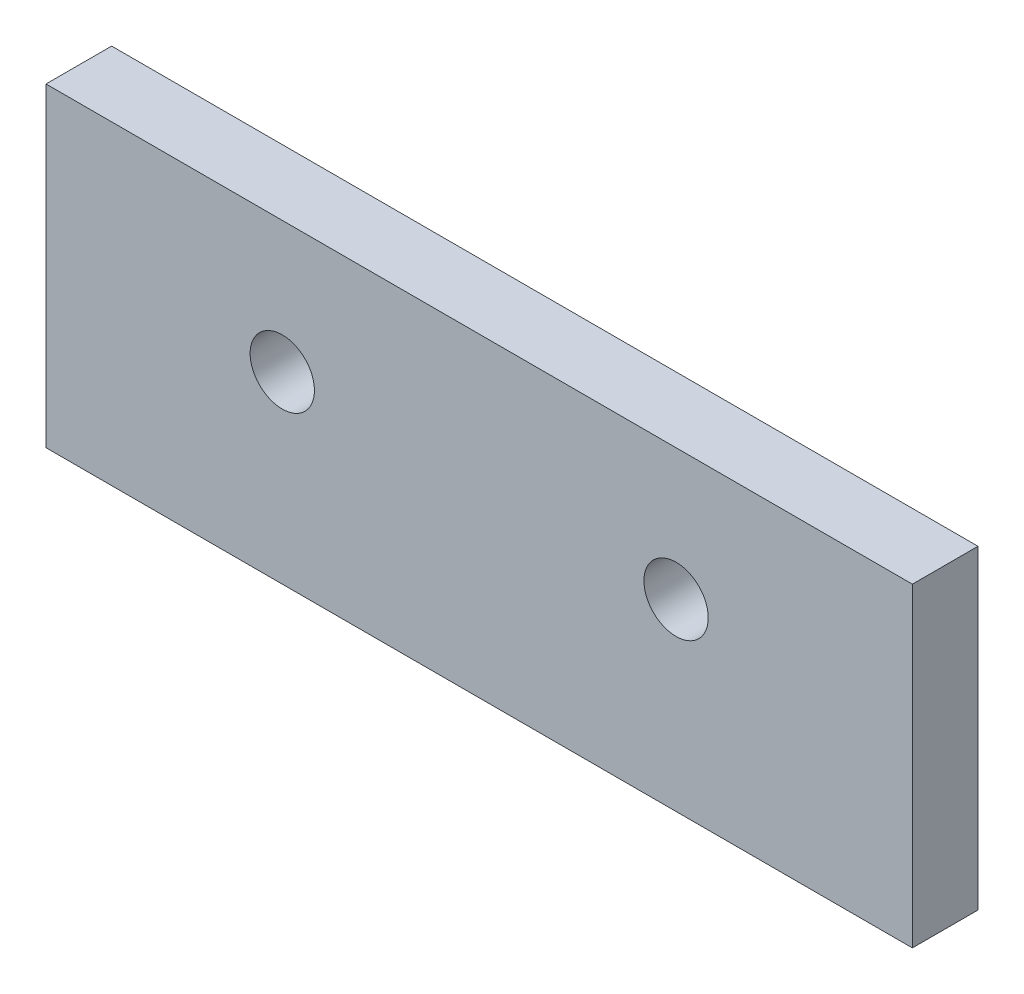
ISO-10303-21;
HEADER;
FILE_DESCRIPTION(('STEP AP214'),'2;1');
FILE_NAME('part.step','',(''),(''),'','','');
FILE_SCHEMA(('AUTOMOTIVE_DESIGN { 1 0 10303 214 1 1 1 1 }'));
ENDSEC;
DATA;
#1=APPLICATION_CONTEXT('core data for automotive mechanical design processes');
#2=APPLICATION_PROTOCOL_DEFINITION('international standard','automotive_design',2000,#1);
#3=PRODUCT_CONTEXT('',#1,'mechanical');
#4=PRODUCT('Part','Part','',(#3));
#5=PRODUCT_RELATED_PRODUCT_CATEGORY('part','',(#4));
#6=PRODUCT_DEFINITION_FORMATION('','',#4);
#7=PRODUCT_DEFINITION_CONTEXT('part definition',#1,'design');
#8=PRODUCT_DEFINITION('design','',#6,#7);
#9=PRODUCT_DEFINITION_SHAPE('','',#8);
#10=(LENGTH_UNIT() NAMED_UNIT(*) SI_UNIT(.MILLI.,.METRE.));
#11=(NAMED_UNIT(*) PLANE_ANGLE_UNIT() SI_UNIT($,.RADIAN.));
#12=(NAMED_UNIT(*) SI_UNIT($,.STERADIAN.) SOLID_ANGLE_UNIT());
#13=UNCERTAINTY_MEASURE_WITH_UNIT(LENGTH_MEASURE(1.E-05),#10,'distance_accuracy_value','');
#14=(GEOMETRIC_REPRESENTATION_CONTEXT(3) GLOBAL_UNCERTAINTY_ASSIGNED_CONTEXT((#13)) GLOBAL_UNIT_ASSIGNED_CONTEXT((#10,
#11,#12)) REPRESENTATION_CONTEXT('',''));
#15=CARTESIAN_POINT('',(0.,0.,0.));
#16=DIRECTION('',(0.,0.,1.));
#17=DIRECTION('',(1.,0.,0.));
#18=AXIS2_PLACEMENT_3D('',#15,#16,#17);
#19=CARTESIAN_POINT('',(0.,0.,5.));
#20=DIRECTION('',(0.,0.,1.));
#21=DIRECTION('',(1.,0.,0.));
#22=AXIS2_PLACEMENT_3D('',#19,#20,#21);
#23=PLANE('',#22);
#24=CARTESIAN_POINT('',(-4.48351648351648,-10.,5.));
#25=DIRECTION('',(0.,0.,1.));
#26=DIRECTION('',(1.,0.,0.));
#27=AXIS2_PLACEMENT_3D('',#24,#25,#26);
#28=CIRCLE('',#27,2.45);
#29=CARTESIAN_POINT('',(-2.03351648351648,-10.,5.));
#30=VERTEX_POINT('',#29);
#31=EDGE_CURVE('E102',#30,#30,#28,.T.);
#32=ORIENTED_EDGE('',*,*,#31,.F.);
#33=EDGE_LOOP('',(#32));
#34=FACE_BOUND('',#33,.T.);
#35=DIRECTION('',(0.,-1.,0.));
#36=VECTOR('',#35,1.);
#37=CARTESIAN_POINT('',(-22.4835164835165,0.,5.));
#38=LINE('',#37,#36);
#39=CARTESIAN_POINT('',(-22.4835164835165,0.,5.));
#40=VERTEX_POINT('',#39);
#41=CARTESIAN_POINT('',(-22.4835164835165,-24.,5.));
#42=VERTEX_POINT('',#41);
#43=EDGE_CURVE('E87',#40,#42,#38,.T.);
#44=ORIENTED_EDGE('',*,*,#43,.T.);
#45=DIRECTION('',(1.,0.,0.));
#46=VECTOR('',#45,1.);
#47=CARTESIAN_POINT('',(-22.4835164835165,-24.,5.));
#48=LINE('',#47,#46);
#49=CARTESIAN_POINT('',(43.5164835164835,-24.,5.));
#50=VERTEX_POINT('',#49);
#51=EDGE_CURVE('E82',#42,#50,#48,.T.);
#52=ORIENTED_EDGE('',*,*,#51,.T.);
#53=DIRECTION('',(0.,1.,0.));
#54=VECTOR('',#53,1.);
#55=CARTESIAN_POINT('',(43.5164835164835,0.,5.));
#56=LINE('',#55,#54);
#57=CARTESIAN_POINT('',(43.5164835164835,0.,5.));
#58=VERTEX_POINT('',#57);
#59=EDGE_CURVE('E85',#50,#58,#56,.T.);
#60=ORIENTED_EDGE('',*,*,#59,.T.);
#61=DIRECTION('',(-1.,0.,0.));
#62=VECTOR('',#61,1.);
#63=CARTESIAN_POINT('',(-22.4835164835165,0.,5.));
#64=LINE('',#63,#62);
#65=EDGE_CURVE('E52',#58,#40,#64,.T.);
#66=ORIENTED_EDGE('',*,*,#65,.T.);
#67=EDGE_LOOP('',(#44,#52,#60,#66));
#68=FACE_BOUND('',#67,.T.);
#69=CARTESIAN_POINT('',(25.5164835164835,-10.,5.));
#70=DIRECTION('',(0.,0.,1.));
#71=DIRECTION('',(1.,0.,0.));
#72=AXIS2_PLACEMENT_3D('',#69,#70,#71);
#73=CIRCLE('',#72,2.45);
#74=CARTESIAN_POINT('',(27.9664835164835,-10.,5.));
#75=VERTEX_POINT('',#74);
#76=EDGE_CURVE('E117',#75,#75,#73,.T.);
#77=ORIENTED_EDGE('',*,*,#76,.F.);
#78=EDGE_LOOP('',(#77));
#79=FACE_BOUND('',#78,.T.);
#80=ADVANCED_FACE('F35',(#34,#68,#79),#23,.T.);
#81=CARTESIAN_POINT('',(0.,0.,0.));
#82=DIRECTION('',(0.,0.,1.));
#83=DIRECTION('',(1.,0.,0.));
#84=AXIS2_PLACEMENT_3D('',#81,#82,#83);
#85=PLANE('',#84);
#86=DIRECTION('',(0.,-1.,0.));
#87=VECTOR('',#86,1.);
#88=CARTESIAN_POINT('',(-22.4835164835165,0.,0.));
#89=LINE('',#88,#87);
#90=CARTESIAN_POINT('',(-22.4835164835165,0.,0.));
#91=VERTEX_POINT('',#90);
#92=CARTESIAN_POINT('',(-22.4835164835165,-24.,0.));
#93=VERTEX_POINT('',#92);
#94=EDGE_CURVE('E99',#91,#93,#89,.T.);
#95=ORIENTED_EDGE('',*,*,#94,.F.);
#96=DIRECTION('',(-1.,0.,0.));
#97=VECTOR('',#96,1.);
#98=CARTESIAN_POINT('',(-22.4835164835165,0.,0.));
#99=LINE('',#98,#97);
#100=CARTESIAN_POINT('',(43.5164835164835,0.,0.));
#101=VERTEX_POINT('',#100);
#102=EDGE_CURVE('E75',#101,#91,#99,.T.);
#103=ORIENTED_EDGE('',*,*,#102,.F.);
#104=DIRECTION('',(0.,1.,0.));
#105=VECTOR('',#104,1.);
#106=CARTESIAN_POINT('',(43.5164835164835,0.,0.));
#107=LINE('',#106,#105);
#108=CARTESIAN_POINT('',(43.5164835164835,-24.,0.));
#109=VERTEX_POINT('',#108);
#110=EDGE_CURVE('E69',#109,#101,#107,.T.);
#111=ORIENTED_EDGE('',*,*,#110,.F.);
#112=DIRECTION('',(1.,0.,0.));
#113=VECTOR('',#112,1.);
#114=CARTESIAN_POINT('',(-22.4835164835165,-24.,0.));
#115=LINE('',#114,#113);
#116=EDGE_CURVE('E91',#93,#109,#115,.T.);
#117=ORIENTED_EDGE('',*,*,#116,.F.);
#118=EDGE_LOOP('',(#95,#103,#111,#117));
#119=FACE_BOUND('',#118,.T.);
#120=CARTESIAN_POINT('',(-4.48351648351648,-10.,0.));
#121=DIRECTION('',(0.,0.,1.));
#122=DIRECTION('',(1.,0.,0.));
#123=AXIS2_PLACEMENT_3D('',#120,#121,#122);
#124=CIRCLE('',#123,2.45);
#125=CARTESIAN_POINT('',(-2.03351648351648,-10.,0.));
#126=VERTEX_POINT('',#125);
#127=EDGE_CURVE('E114',#126,#126,#124,.T.);
#128=ORIENTED_EDGE('',*,*,#127,.T.);
#129=EDGE_LOOP('',(#128));
#130=FACE_BOUND('',#129,.T.);
#131=CARTESIAN_POINT('',(25.5164835164835,-10.,0.));
#132=DIRECTION('',(0.,0.,1.));
#133=DIRECTION('',(1.,0.,0.));
#134=AXIS2_PLACEMENT_3D('',#131,#132,#133);
#135=CIRCLE('',#134,2.45);
#136=CARTESIAN_POINT('',(27.9664835164835,-10.,0.));
#137=VERTEX_POINT('',#136);
#138=EDGE_CURVE('E120',#137,#137,#135,.T.);
#139=ORIENTED_EDGE('',*,*,#138,.T.);
#140=EDGE_LOOP('',(#139));
#141=FACE_BOUND('',#140,.T.);
#142=ADVANCED_FACE('F110',(#119,#130,#141),#85,.F.);
#143=CARTESIAN_POINT('',(-22.4835164835165,0.,5.));
#144=DIRECTION('',(1.,0.,0.));
#145=DIRECTION('',(0.,0.,-1.));
#146=AXIS2_PLACEMENT_3D('',#143,#144,#145);
#147=PLANE('',#146);
#148=ORIENTED_EDGE('',*,*,#94,.T.);
#149=DIRECTION('',(0.,0.,-1.));
#150=VECTOR('',#149,1.);
#151=CARTESIAN_POINT('',(-22.4835164835165,-24.,5.));
#152=LINE('',#151,#150);
#153=EDGE_CURVE('E11',#42,#93,#152,.T.);
#154=ORIENTED_EDGE('',*,*,#153,.F.);
#155=ORIENTED_EDGE('',*,*,#43,.F.);
#156=DIRECTION('',(0.,0.,-1.));
#157=VECTOR('',#156,1.);
#158=CARTESIAN_POINT('',(-22.4835164835165,0.,5.));
#159=LINE('',#158,#157);
#160=EDGE_CURVE('E95',#40,#91,#159,.T.);
#161=ORIENTED_EDGE('',*,*,#160,.T.);
#162=EDGE_LOOP('',(#148,#154,#155,#161));
#163=FACE_BOUND('',#162,.T.);
#164=ADVANCED_FACE('F37',(#163),#147,.F.);
#165=CARTESIAN_POINT('',(-22.4835164835165,-24.,5.));
#166=DIRECTION('',(0.,1.,0.));
#167=DIRECTION('',(0.,0.,1.));
#168=AXIS2_PLACEMENT_3D('',#165,#166,#167);
#169=PLANE('',#168);
#170=ORIENTED_EDGE('',*,*,#116,.T.);
#171=DIRECTION('',(0.,0.,-1.));
#172=VECTOR('',#171,1.);
#173=CARTESIAN_POINT('',(43.5164835164835,-24.,5.));
#174=LINE('',#173,#172);
#175=EDGE_CURVE('E44',#50,#109,#174,.T.);
#176=ORIENTED_EDGE('',*,*,#175,.F.);
#177=ORIENTED_EDGE('',*,*,#51,.F.);
#178=ORIENTED_EDGE('',*,*,#153,.T.);
#179=EDGE_LOOP('',(#170,#176,#177,#178));
#180=FACE_BOUND('',#179,.T.);
#181=ADVANCED_FACE('F90',(#180),#169,.F.);
#182=CARTESIAN_POINT('',(43.5164835164835,0.,5.));
#183=DIRECTION('',(-1.,0.,0.));
#184=DIRECTION('',(0.,0.,1.));
#185=AXIS2_PLACEMENT_3D('',#182,#183,#184);
#186=PLANE('',#185);
#187=ORIENTED_EDGE('',*,*,#110,.T.);
#188=DIRECTION('',(0.,0.,-1.));
#189=VECTOR('',#188,1.);
#190=CARTESIAN_POINT('',(43.5164835164835,0.,5.));
#191=LINE('',#190,#189);
#192=EDGE_CURVE('E92',#58,#101,#191,.T.);
#193=ORIENTED_EDGE('',*,*,#192,.F.);
#194=ORIENTED_EDGE('',*,*,#59,.F.);
#195=ORIENTED_EDGE('',*,*,#175,.T.);
#196=EDGE_LOOP('',(#187,#193,#194,#195));
#197=FACE_BOUND('',#196,.T.);
#198=ADVANCED_FACE('F93',(#197),#186,.F.);
#199=CARTESIAN_POINT('',(-22.4835164835165,0.,5.));
#200=DIRECTION('',(0.,-1.,0.));
#201=DIRECTION('',(0.,0.,-1.));
#202=AXIS2_PLACEMENT_3D('',#199,#200,#201);
#203=PLANE('',#202);
#204=ORIENTED_EDGE('',*,*,#102,.T.);
#205=ORIENTED_EDGE('',*,*,#160,.F.);
#206=ORIENTED_EDGE('',*,*,#65,.F.);
#207=ORIENTED_EDGE('',*,*,#192,.T.);
#208=EDGE_LOOP('',(#204,#205,#206,#207));
#209=FACE_BOUND('',#208,.T.);
#210=ADVANCED_FACE('F107',(#209),#203,.F.);
#211=CARTESIAN_POINT('',(-4.48351648351648,-10.,5.));
#212=DIRECTION('',(0.,0.,-1.));
#213=DIRECTION('',(-1.,0.,0.));
#214=AXIS2_PLACEMENT_3D('',#211,#212,#213);
#215=CYLINDRICAL_SURFACE('',#214,2.45);
#216=ORIENTED_EDGE('',*,*,#31,.T.);
#217=EDGE_LOOP('',(#216));
#218=FACE_BOUND('',#217,.T.);
#219=ORIENTED_EDGE('',*,*,#127,.F.);
#220=EDGE_LOOP('',(#219));
#221=FACE_BOUND('',#220,.T.);
#222=ADVANCED_FACE('F137',(#218,#221),#215,.F.);
#223=CARTESIAN_POINT('',(25.5164835164835,-10.,5.));
#224=DIRECTION('',(0.,0.,-1.));
#225=DIRECTION('',(-1.,0.,0.));
#226=AXIS2_PLACEMENT_3D('',#223,#224,#225);
#227=CYLINDRICAL_SURFACE('',#226,2.45);
#228=ORIENTED_EDGE('',*,*,#76,.T.);
#229=EDGE_LOOP('',(#228));
#230=FACE_BOUND('',#229,.T.);
#231=ORIENTED_EDGE('',*,*,#138,.F.);
#232=EDGE_LOOP('',(#231));
#233=FACE_BOUND('',#232,.T.);
#234=ADVANCED_FACE('F126',(#230,#233),#227,.F.);
#235=CLOSED_SHELL('',(#80,#142,#164,#181,#198,#210,#222,#234));
#236=MANIFOLD_SOLID_BREP('B2',#235);
#237=ADVANCED_BREP_SHAPE_REPRESENTATION('',(#18,#236),#14);
#238=SHAPE_DEFINITION_REPRESENTATION(#9,#237);
ENDSEC;
END-ISO-10303-21;
